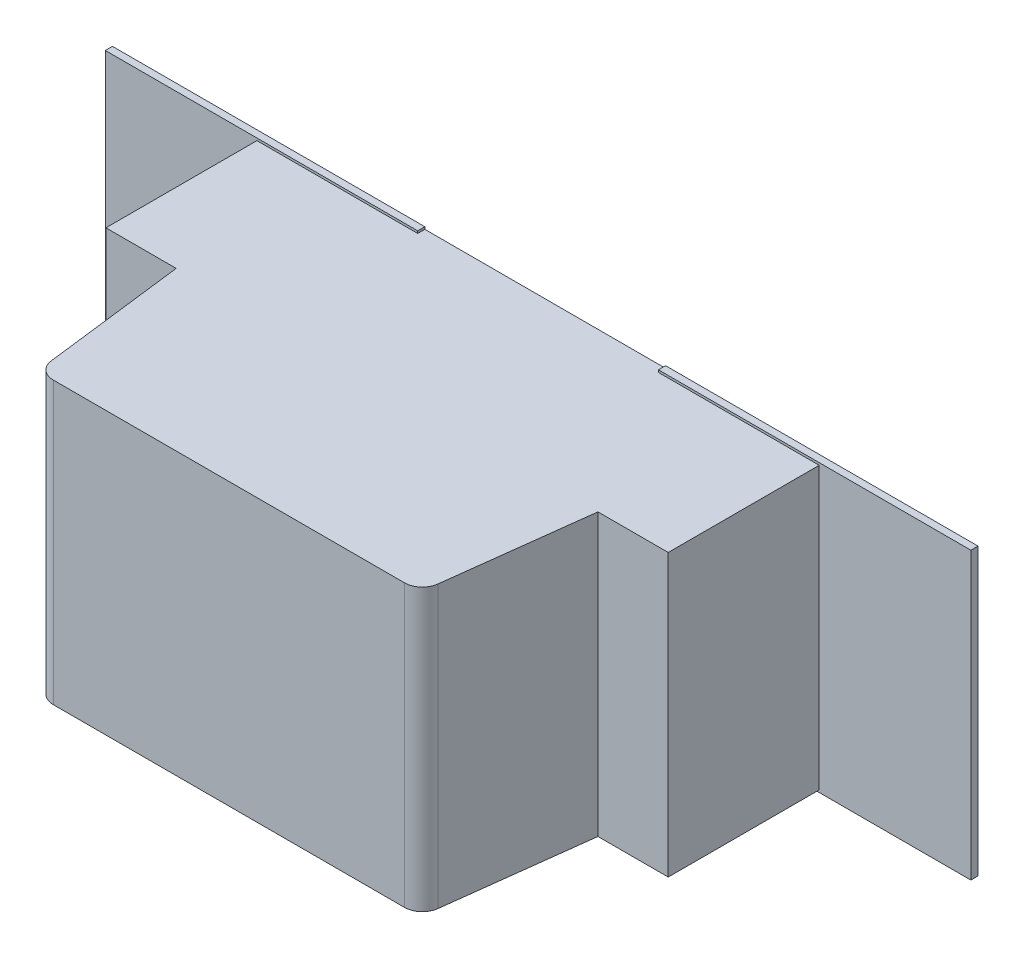
ISO-10303-21;
HEADER;
FILE_DESCRIPTION(('STEP AP214'),'2;1');
FILE_NAME('part.step','',(''),(''),'','','');
FILE_SCHEMA(('AUTOMOTIVE_DESIGN { 1 0 10303 214 1 1 1 1 }'));
ENDSEC;
DATA;
#1=APPLICATION_CONTEXT('core data for automotive mechanical design processes');
#2=APPLICATION_PROTOCOL_DEFINITION('international standard','automotive_design',2000,#1);
#3=PRODUCT_CONTEXT('',#1,'mechanical');
#4=PRODUCT('Part','Part','',(#3));
#5=PRODUCT_RELATED_PRODUCT_CATEGORY('part','',(#4));
#6=PRODUCT_DEFINITION_FORMATION('','',#4);
#7=PRODUCT_DEFINITION_CONTEXT('part definition',#1,'design');
#8=PRODUCT_DEFINITION('design','',#6,#7);
#9=PRODUCT_DEFINITION_SHAPE('','',#8);
#10=(LENGTH_UNIT() NAMED_UNIT(*) SI_UNIT(.MILLI.,.METRE.));
#11=(NAMED_UNIT(*) PLANE_ANGLE_UNIT() SI_UNIT($,.RADIAN.));
#12=(NAMED_UNIT(*) SI_UNIT($,.STERADIAN.) SOLID_ANGLE_UNIT());
#13=UNCERTAINTY_MEASURE_WITH_UNIT(LENGTH_MEASURE(1.E-05),#10,'distance_accuracy_value','');
#14=(GEOMETRIC_REPRESENTATION_CONTEXT(3) GLOBAL_UNCERTAINTY_ASSIGNED_CONTEXT((#13)) GLOBAL_UNIT_ASSIGNED_CONTEXT((#10,
#11,#12)) REPRESENTATION_CONTEXT('',''));
#15=CARTESIAN_POINT('',(0.,0.,0.));
#16=DIRECTION('',(0.,0.,1.));
#17=DIRECTION('',(1.,0.,0.));
#18=AXIS2_PLACEMENT_3D('',#15,#16,#17);
#19=CARTESIAN_POINT('',(1.2314936,0.4065016,0.0762));
#20=DIRECTION('',(0.,1.,0.));
#21=DIRECTION('',(1.,0.,0.));
#22=AXIS2_PLACEMENT_3D('',#19,#20,#21);
#23=PLANE('',#22);
#24=DIRECTION('',(-1.,0.,0.));
#25=VECTOR('',#24,1.);
#26=CARTESIAN_POINT('',(1.2314936,0.4065016,0.0762));
#27=LINE('',#26,#25);
#28=CARTESIAN_POINT('',(1.2314936,0.4065016,0.0762));
#29=VERTEX_POINT('',#28);
#30=CARTESIAN_POINT('',(0.3424936,0.4065016,0.0762));
#31=VERTEX_POINT('',#30);
#32=EDGE_CURVE('E295',#29,#31,#27,.T.);
#33=ORIENTED_EDGE('',*,*,#32,.T.);
#34=DIRECTION('',(0.,0.,1.));
#35=VECTOR('',#34,1.);
#36=CARTESIAN_POINT('',(0.3424936,0.4065016,0.0762));
#37=LINE('',#36,#35);
#38=CARTESIAN_POINT('',(0.3424936,0.4065016,0.09652));
#39=VERTEX_POINT('',#38);
#40=EDGE_CURVE('E317',#31,#39,#37,.T.);
#41=ORIENTED_EDGE('',*,*,#40,.T.);
#42=DIRECTION('',(-1.,0.,0.));
#43=VECTOR('',#42,1.);
#44=CARTESIAN_POINT('',(1.2314936,0.4065016,0.09652));
#45=LINE('',#44,#43);
#46=CARTESIAN_POINT('',(1.2314936,0.4065016,0.09652));
#47=VERTEX_POINT('',#46);
#48=EDGE_CURVE('E340',#47,#39,#45,.T.);
#49=ORIENTED_EDGE('',*,*,#48,.F.);
#50=DIRECTION('',(0.,0.,1.));
#51=VECTOR('',#50,1.);
#52=CARTESIAN_POINT('',(1.2314936,0.4065016,0.0762));
#53=LINE('',#52,#51);
#54=EDGE_CURVE('E11',#29,#47,#53,.T.);
#55=ORIENTED_EDGE('',*,*,#54,.F.);
#56=EDGE_LOOP('',(#33,#41,#49,#55));
#57=FACE_BOUND('',#56,.T.);
#58=ADVANCED_FACE('F17',(#57),#23,.T.);
#59=CARTESIAN_POINT('',(1.2314936,-0.4065016,0.0762));
#60=DIRECTION('',(1.,0.,0.));
#61=DIRECTION('',(0.,1.,0.));
#62=AXIS2_PLACEMENT_3D('',#59,#60,#61);
#63=PLANE('',#62);
#64=DIRECTION('',(0.,1.,0.));
#65=VECTOR('',#64,1.);
#66=CARTESIAN_POINT('',(1.2314936,-0.4065016,0.0762));
#67=LINE('',#66,#65);
#68=CARTESIAN_POINT('',(1.2314936,-0.4065016,0.0762));
#69=VERTEX_POINT('',#68);
#70=EDGE_CURVE('E290',#69,#29,#67,.T.);
#71=ORIENTED_EDGE('',*,*,#70,.T.);
#72=ORIENTED_EDGE('',*,*,#54,.T.);
#73=DIRECTION('',(0.,1.,0.));
#74=VECTOR('',#73,1.);
#75=CARTESIAN_POINT('',(1.2314936,-0.4065016,0.09652));
#76=LINE('',#75,#74);
#77=CARTESIAN_POINT('',(1.2314936,-0.4065016,0.09652));
#78=VERTEX_POINT('',#77);
#79=EDGE_CURVE('E384',#78,#47,#76,.T.);
#80=ORIENTED_EDGE('',*,*,#79,.F.);
#81=DIRECTION('',(0.,0.,1.));
#82=VECTOR('',#81,1.);
#83=CARTESIAN_POINT('',(1.2314936,-0.4065016,0.0762));
#84=LINE('',#83,#82);
#85=EDGE_CURVE('E28',#69,#78,#84,.T.);
#86=ORIENTED_EDGE('',*,*,#85,.F.);
#87=EDGE_LOOP('',(#71,#72,#80,#86));
#88=FACE_BOUND('',#87,.T.);
#89=ADVANCED_FACE('F514',(#88),#63,.T.);
#90=CARTESIAN_POINT('',(0.3424936,-0.4065016,0.0762));
#91=DIRECTION('',(0.,-1.,0.));
#92=DIRECTION('',(0.,0.,-1.));
#93=AXIS2_PLACEMENT_3D('',#90,#91,#92);
#94=PLANE('',#93);
#95=DIRECTION('',(1.,0.,0.));
#96=VECTOR('',#95,1.);
#97=CARTESIAN_POINT('',(0.3424936,-0.4065016,0.0762));
#98=LINE('',#97,#96);
#99=CARTESIAN_POINT('',(0.3424936,-0.4065016,0.0762));
#100=VERTEX_POINT('',#99);
#101=EDGE_CURVE('E294',#100,#69,#98,.T.);
#102=ORIENTED_EDGE('',*,*,#101,.T.);
#103=ORIENTED_EDGE('',*,*,#85,.T.);
#104=DIRECTION('',(1.,0.,0.));
#105=VECTOR('',#104,1.);
#106=CARTESIAN_POINT('',(0.3424936,-0.4065016,0.09652));
#107=LINE('',#106,#105);
#108=CARTESIAN_POINT('',(0.3424936,-0.4065016,0.09652));
#109=VERTEX_POINT('',#108);
#110=EDGE_CURVE('E380',#109,#78,#107,.T.);
#111=ORIENTED_EDGE('',*,*,#110,.F.);
#112=DIRECTION('',(0.,0.,1.));
#113=VECTOR('',#112,1.);
#114=CARTESIAN_POINT('',(0.3424936,-0.4065016,0.0762));
#115=LINE('',#114,#113);
#116=EDGE_CURVE('E195',#100,#109,#115,.T.);
#117=ORIENTED_EDGE('',*,*,#116,.F.);
#118=EDGE_LOOP('',(#102,#103,#111,#117));
#119=FACE_BOUND('',#118,.T.);
#120=ADVANCED_FACE('F516',(#119),#94,.T.);
#121=CARTESIAN_POINT('',(0.3424936,0.4065016,0.0762));
#122=DIRECTION('',(-1.,0.,0.));
#123=DIRECTION('',(0.,0.,1.));
#124=AXIS2_PLACEMENT_3D('',#121,#122,#123);
#125=PLANE('',#124);
#126=DIRECTION('',(0.,0.,1.));
#127=VECTOR('',#126,1.);
#128=CARTESIAN_POINT('',(0.3424936,0.4,0.0762));
#129=LINE('',#128,#127);
#130=CARTESIAN_POINT('',(0.3424936,0.4,0.0762));
#131=VERTEX_POINT('',#130);
#132=CARTESIAN_POINT('',(0.3424936,0.4,0.09652));
#133=VERTEX_POINT('',#132);
#134=EDGE_CURVE('E282',#131,#133,#129,.T.);
#135=ORIENTED_EDGE('',*,*,#134,.T.);
#136=DIRECTION('',(0.,-1.,0.));
#137=VECTOR('',#136,1.);
#138=CARTESIAN_POINT('',(0.3424936,0.4065016,0.09652));
#139=LINE('',#138,#137);
#140=EDGE_CURVE('E335',#39,#133,#139,.T.);
#141=ORIENTED_EDGE('',*,*,#140,.F.);
#142=ORIENTED_EDGE('',*,*,#40,.F.);
#143=DIRECTION('',(0.,-1.,0.));
#144=VECTOR('',#143,1.);
#145=CARTESIAN_POINT('',(0.3424936,0.4065016,0.0762));
#146=LINE('',#145,#144);
#147=EDGE_CURVE('E362',#31,#131,#146,.T.);
#148=ORIENTED_EDGE('',*,*,#147,.T.);
#149=EDGE_LOOP('',(#135,#141,#142,#148));
#150=FACE_BOUND('',#149,.T.);
#151=ADVANCED_FACE('F504',(#150),#125,.T.);
#152=CARTESIAN_POINT('',(0.3424936,0.4065016,0.0762));
#153=DIRECTION('',(-1.,0.,0.));
#154=DIRECTION('',(0.,0.,1.));
#155=AXIS2_PLACEMENT_3D('',#152,#153,#154);
#156=PLANE('',#155);
#157=DIRECTION('',(0.,0.,1.));
#158=VECTOR('',#157,1.);
#159=CARTESIAN_POINT('',(0.3424936,-0.4,0.0762));
#160=LINE('',#159,#158);
#161=CARTESIAN_POINT('',(0.3424936,-0.4,0.0762));
#162=VERTEX_POINT('',#161);
#163=CARTESIAN_POINT('',(0.3424936,-0.4,0.09652));
#164=VERTEX_POINT('',#163);
#165=EDGE_CURVE('E444',#162,#164,#160,.T.);
#166=ORIENTED_EDGE('',*,*,#165,.F.);
#167=DIRECTION('',(0.,-1.,0.));
#168=VECTOR('',#167,1.);
#169=CARTESIAN_POINT('',(0.3424936,-0.4,0.0762));
#170=LINE('',#169,#168);
#171=EDGE_CURVE('E202',#162,#100,#170,.T.);
#172=ORIENTED_EDGE('',*,*,#171,.T.);
#173=ORIENTED_EDGE('',*,*,#116,.T.);
#174=DIRECTION('',(0.,-1.,0.));
#175=VECTOR('',#174,1.);
#176=CARTESIAN_POINT('',(0.3424936,-0.4,0.09652));
#177=LINE('',#176,#175);
#178=EDGE_CURVE('E385',#164,#109,#177,.T.);
#179=ORIENTED_EDGE('',*,*,#178,.F.);
#180=EDGE_LOOP('',(#166,#172,#173,#179));
#181=FACE_BOUND('',#180,.T.);
#182=ADVANCED_FACE('F517',(#181),#156,.T.);
#183=CARTESIAN_POINT('',(-1.2314936,-0.4065016,0.0762));
#184=DIRECTION('',(0.,-1.,0.));
#185=DIRECTION('',(0.,0.,-1.));
#186=AXIS2_PLACEMENT_3D('',#183,#184,#185);
#187=PLANE('',#186);
#188=DIRECTION('',(1.,0.,0.));
#189=VECTOR('',#188,1.);
#190=CARTESIAN_POINT('',(-1.2314936,-0.4065016,0.0762));
#191=LINE('',#190,#189);
#192=CARTESIAN_POINT('',(-1.2314936,-0.4065016,0.0762));
#193=VERTEX_POINT('',#192);
#194=CARTESIAN_POINT('',(-0.3424936,-0.4065016,0.0762));
#195=VERTEX_POINT('',#194);
#196=EDGE_CURVE('E138',#193,#195,#191,.T.);
#197=ORIENTED_EDGE('',*,*,#196,.T.);
#198=DIRECTION('',(0.,0.,1.));
#199=VECTOR('',#198,1.);
#200=CARTESIAN_POINT('',(-0.3424936,-0.4065016,0.0762));
#201=LINE('',#200,#199);
#202=CARTESIAN_POINT('',(-0.3424936,-0.4065016,0.09652));
#203=VERTEX_POINT('',#202);
#204=EDGE_CURVE('E114',#195,#203,#201,.T.);
#205=ORIENTED_EDGE('',*,*,#204,.T.);
#206=DIRECTION('',(1.,0.,0.));
#207=VECTOR('',#206,1.);
#208=CARTESIAN_POINT('',(-1.2314936,-0.4065016,0.09652));
#209=LINE('',#208,#207);
#210=CARTESIAN_POINT('',(-1.2314936,-0.4065016,0.09652));
#211=VERTEX_POINT('',#210);
#212=EDGE_CURVE('E334',#211,#203,#209,.T.);
#213=ORIENTED_EDGE('',*,*,#212,.F.);
#214=DIRECTION('',(0.,0.,1.));
#215=VECTOR('',#214,1.);
#216=CARTESIAN_POINT('',(-1.2314936,-0.4065016,0.0762));
#217=LINE('',#216,#215);
#218=EDGE_CURVE('E21',#193,#211,#217,.T.);
#219=ORIENTED_EDGE('',*,*,#218,.F.);
#220=EDGE_LOOP('',(#197,#205,#213,#219));
#221=FACE_BOUND('',#220,.T.);
#222=ADVANCED_FACE('F469',(#221),#187,.T.);
#223=CARTESIAN_POINT('',(-1.2314936,0.4065016,0.0762));
#224=DIRECTION('',(-1.,0.,0.));
#225=DIRECTION('',(0.,0.,1.));
#226=AXIS2_PLACEMENT_3D('',#223,#224,#225);
#227=PLANE('',#226);
#228=DIRECTION('',(0.,-1.,0.));
#229=VECTOR('',#228,1.);
#230=CARTESIAN_POINT('',(-1.2314936,0.4065016,0.0762));
#231=LINE('',#230,#229);
#232=CARTESIAN_POINT('',(-1.2314936,0.4065016,0.0762));
#233=VERTEX_POINT('',#232);
#234=EDGE_CURVE('E304',#233,#193,#231,.T.);
#235=ORIENTED_EDGE('',*,*,#234,.T.);
#236=ORIENTED_EDGE('',*,*,#218,.T.);
#237=DIRECTION('',(0.,-1.,0.));
#238=VECTOR('',#237,1.);
#239=CARTESIAN_POINT('',(-1.2314936,0.4065016,0.09652));
#240=LINE('',#239,#238);
#241=CARTESIAN_POINT('',(-1.2314936,0.4065016,0.09652));
#242=VERTEX_POINT('',#241);
#243=EDGE_CURVE('E371',#242,#211,#240,.T.);
#244=ORIENTED_EDGE('',*,*,#243,.F.);
#245=DIRECTION('',(0.,0.,1.));
#246=VECTOR('',#245,1.);
#247=CARTESIAN_POINT('',(-1.2314936,0.4065016,0.0762));
#248=LINE('',#247,#246);
#249=EDGE_CURVE('E42',#233,#242,#248,.T.);
#250=ORIENTED_EDGE('',*,*,#249,.F.);
#251=EDGE_LOOP('',(#235,#236,#244,#250));
#252=FACE_BOUND('',#251,.T.);
#253=ADVANCED_FACE('F465',(#252),#227,.T.);
#254=CARTESIAN_POINT('',(-0.3424936,0.4065016,0.0762));
#255=DIRECTION('',(0.,1.,0.));
#256=DIRECTION('',(1.,0.,0.));
#257=AXIS2_PLACEMENT_3D('',#254,#255,#256);
#258=PLANE('',#257);
#259=DIRECTION('',(-1.,0.,0.));
#260=VECTOR('',#259,1.);
#261=CARTESIAN_POINT('',(-0.3424936,0.4065016,0.0762));
#262=LINE('',#261,#260);
#263=CARTESIAN_POINT('',(-0.3424936,0.4065016,0.0762));
#264=VERTEX_POINT('',#263);
#265=EDGE_CURVE('E307',#264,#233,#262,.T.);
#266=ORIENTED_EDGE('',*,*,#265,.T.);
#267=ORIENTED_EDGE('',*,*,#249,.T.);
#268=DIRECTION('',(-1.,0.,0.));
#269=VECTOR('',#268,1.);
#270=CARTESIAN_POINT('',(-0.3424936,0.4065016,0.09652));
#271=LINE('',#270,#269);
#272=CARTESIAN_POINT('',(-0.3424936,0.4065016,0.09652));
#273=VERTEX_POINT('',#272);
#274=EDGE_CURVE('E352',#273,#242,#271,.T.);
#275=ORIENTED_EDGE('',*,*,#274,.F.);
#276=DIRECTION('',(0.,0.,1.));
#277=VECTOR('',#276,1.);
#278=CARTESIAN_POINT('',(-0.3424936,0.4065016,0.0762));
#279=LINE('',#278,#277);
#280=EDGE_CURVE('E395',#264,#273,#279,.T.);
#281=ORIENTED_EDGE('',*,*,#280,.F.);
#282=EDGE_LOOP('',(#266,#267,#275,#281));
#283=FACE_BOUND('',#282,.T.);
#284=ADVANCED_FACE('F462',(#283),#258,.T.);
#285=CARTESIAN_POINT('',(0.8,-0.4,0.0762));
#286=DIRECTION('',(0.,0.,-1.));
#287=DIRECTION('',(0.,-1.,0.));
#288=AXIS2_PLACEMENT_3D('',#285,#286,#287);
#289=PLANE('',#288);
#290=DIRECTION('',(-1.,0.,0.));
#291=VECTOR('',#290,1.);
#292=CARTESIAN_POINT('',(0.3424936,0.4,0.0762));
#293=LINE('',#292,#291);
#294=CARTESIAN_POINT('',(-0.3424936,0.4,0.0762));
#295=VERTEX_POINT('',#294);
#296=EDGE_CURVE('E285',#131,#295,#293,.T.);
#297=ORIENTED_EDGE('',*,*,#296,.F.);
#298=ORIENTED_EDGE('',*,*,#147,.F.);
#299=ORIENTED_EDGE('',*,*,#32,.F.);
#300=ORIENTED_EDGE('',*,*,#70,.F.);
#301=ORIENTED_EDGE('',*,*,#101,.F.);
#302=ORIENTED_EDGE('',*,*,#171,.F.);
#303=DIRECTION('',(-1.,0.,0.));
#304=VECTOR('',#303,1.);
#305=CARTESIAN_POINT('',(0.3424936,-0.4,0.0762));
#306=LINE('',#305,#304);
#307=CARTESIAN_POINT('',(-0.3424936,-0.4,0.0762));
#308=VERTEX_POINT('',#307);
#309=EDGE_CURVE('E426',#162,#308,#306,.T.);
#310=ORIENTED_EDGE('',*,*,#309,.T.);
#311=DIRECTION('',(0.,1.,0.));
#312=VECTOR('',#311,1.);
#313=CARTESIAN_POINT('',(-0.3424936,-0.4065016,0.0762));
#314=LINE('',#313,#312);
#315=EDGE_CURVE('E209',#195,#308,#314,.T.);
#316=ORIENTED_EDGE('',*,*,#315,.F.);
#317=ORIENTED_EDGE('',*,*,#196,.F.);
#318=ORIENTED_EDGE('',*,*,#234,.F.);
#319=ORIENTED_EDGE('',*,*,#265,.F.);
#320=DIRECTION('',(0.,1.,0.));
#321=VECTOR('',#320,1.);
#322=CARTESIAN_POINT('',(-0.3424936,0.4,0.0762));
#323=LINE('',#322,#321);
#324=EDGE_CURVE('E130',#295,#264,#323,.T.);
#325=ORIENTED_EDGE('',*,*,#324,.F.);
#326=EDGE_LOOP('',(#297,#298,#299,#300,#301,#302,#310,#316,#317,#318,#319,#325));
#327=FACE_BOUND('',#326,.T.);
#328=ADVANCED_FACE('F464',(#327),#289,.T.);
#329=CARTESIAN_POINT('',(-0.3424936,-0.4065016,0.0762));
#330=DIRECTION('',(1.,0.,0.));
#331=DIRECTION('',(0.,1.,0.));
#332=AXIS2_PLACEMENT_3D('',#329,#330,#331);
#333=PLANE('',#332);
#334=DIRECTION('',(0.,0.,1.));
#335=VECTOR('',#334,1.);
#336=CARTESIAN_POINT('',(-0.3424936,0.4,0.0762));
#337=LINE('',#336,#335);
#338=CARTESIAN_POINT('',(-0.3424936,0.4,0.09652));
#339=VERTEX_POINT('',#338);
#340=EDGE_CURVE('E289',#295,#339,#337,.T.);
#341=ORIENTED_EDGE('',*,*,#340,.F.);
#342=ORIENTED_EDGE('',*,*,#324,.T.);
#343=ORIENTED_EDGE('',*,*,#280,.T.);
#344=DIRECTION('',(0.,1.,0.));
#345=VECTOR('',#344,1.);
#346=CARTESIAN_POINT('',(-0.3424936,0.4,0.09652));
#347=LINE('',#346,#345);
#348=EDGE_CURVE('E348',#339,#273,#347,.T.);
#349=ORIENTED_EDGE('',*,*,#348,.F.);
#350=EDGE_LOOP('',(#341,#342,#343,#349));
#351=FACE_BOUND('',#350,.T.);
#352=ADVANCED_FACE('F555',(#351),#333,.T.);
#353=CARTESIAN_POINT('',(-0.3424936,-0.4065016,0.0762));
#354=DIRECTION('',(1.,0.,0.));
#355=DIRECTION('',(0.,1.,0.));
#356=AXIS2_PLACEMENT_3D('',#353,#354,#355);
#357=PLANE('',#356);
#358=DIRECTION('',(0.,0.,1.));
#359=VECTOR('',#358,1.);
#360=CARTESIAN_POINT('',(-0.3424936,-0.4,0.0762));
#361=LINE('',#360,#359);
#362=CARTESIAN_POINT('',(-0.3424936,-0.4,0.09652));
#363=VERTEX_POINT('',#362);
#364=EDGE_CURVE('E322',#308,#363,#361,.T.);
#365=ORIENTED_EDGE('',*,*,#364,.T.);
#366=DIRECTION('',(0.,1.,0.));
#367=VECTOR('',#366,1.);
#368=CARTESIAN_POINT('',(-0.3424936,-0.4065016,0.09652));
#369=LINE('',#368,#367);
#370=EDGE_CURVE('E330',#203,#363,#369,.T.);
#371=ORIENTED_EDGE('',*,*,#370,.F.);
#372=ORIENTED_EDGE('',*,*,#204,.F.);
#373=ORIENTED_EDGE('',*,*,#315,.T.);
#374=EDGE_LOOP('',(#365,#371,#372,#373));
#375=FACE_BOUND('',#374,.T.);
#376=ADVANCED_FACE('F553',(#375),#357,.T.);
#377=CARTESIAN_POINT('',(0.,0.4,0.0762));
#378=DIRECTION('',(0.,1.,0.));
#379=DIRECTION('',(1.,0.,0.));
#380=AXIS2_PLACEMENT_3D('',#377,#378,#379);
#381=PLANE('',#380);
#382=DIRECTION('',(-1.,0.,0.));
#383=VECTOR('',#382,1.);
#384=CARTESIAN_POINT('',(0.8,0.4,0.09652));
#385=LINE('',#384,#383);
#386=CARTESIAN_POINT('',(0.8,0.4,0.09652));
#387=VERTEX_POINT('',#386);
#388=EDGE_CURVE('E339',#387,#133,#385,.T.);
#389=ORIENTED_EDGE('',*,*,#388,.T.);
#390=ORIENTED_EDGE('',*,*,#134,.F.);
#391=ORIENTED_EDGE('',*,*,#296,.T.);
#392=ORIENTED_EDGE('',*,*,#340,.T.);
#393=DIRECTION('',(-1.,0.,0.));
#394=VECTOR('',#393,1.);
#395=CARTESIAN_POINT('',(-0.3424936,0.4,0.09652));
#396=LINE('',#395,#394);
#397=CARTESIAN_POINT('',(-0.8,0.4,0.09652));
#398=VERTEX_POINT('',#397);
#399=EDGE_CURVE('E353',#339,#398,#396,.T.);
#400=ORIENTED_EDGE('',*,*,#399,.T.);
#401=DIRECTION('',(0.,0.,1.));
#402=VECTOR('',#401,1.);
#403=CARTESIAN_POINT('',(-0.8,0.4,0.09652));
#404=LINE('',#403,#402);
#405=CARTESIAN_POINT('',(-0.8,0.4,0.5262));
#406=VERTEX_POINT('',#405);
#407=EDGE_CURVE('E286',#398,#406,#404,.T.);
#408=ORIENTED_EDGE('',*,*,#407,.T.);
#409=DIRECTION('',(1.,0.,0.));
#410=VECTOR('',#409,1.);
#411=CARTESIAN_POINT('',(-0.8,0.4,0.5262));
#412=LINE('',#411,#410);
#413=CARTESIAN_POINT('',(-0.6,0.4,0.5262));
#414=VERTEX_POINT('',#413);
#415=EDGE_CURVE('E389',#406,#414,#412,.T.);
#416=ORIENTED_EDGE('',*,*,#415,.T.);
#417=DIRECTION('',(0.122402128164196,0.,0.992480588737571));
#418=VECTOR('',#417,1.);
#419=CARTESIAN_POINT('',(-0.6,0.4,0.5262));
#420=LINE('',#419,#418);
#421=CARTESIAN_POINT('',(-0.55,0.4,0.9316180281107));
#422=VERTEX_POINT('',#421);
#423=EDGE_CURVE('E324',#414,#422,#420,.T.);
#424=ORIENTED_EDGE('',*,*,#423,.T.);
#425=CARTESIAN_POINT('',(-0.4995819860921,0.4,0.9254));
#426=DIRECTION('',(0.,1.,0.));
#427=DIRECTION('',(-0.992480588737571,0.,0.122402128164196));
#428=AXIS2_PLACEMENT_3D('',#425,#426,#427);
#429=CIRCLE('',#428,0.0508);
#430=CARTESIAN_POINT('',(-0.4995819860921,0.4,0.9762));
#431=VERTEX_POINT('',#430);
#432=EDGE_CURVE('E344',#422,#431,#429,.T.);
#433=ORIENTED_EDGE('',*,*,#432,.T.);
#434=DIRECTION('',(1.,0.,0.));
#435=VECTOR('',#434,1.);
#436=CARTESIAN_POINT('',(-0.4995819860921,0.4,0.9762));
#437=LINE('',#436,#435);
#438=CARTESIAN_POINT('',(0.4995819860921,0.4,0.9762));
#439=VERTEX_POINT('',#438);
#440=EDGE_CURVE('E244',#431,#439,#437,.T.);
#441=ORIENTED_EDGE('',*,*,#440,.T.);
#442=CARTESIAN_POINT('',(0.4995819860921,0.4,0.9254));
#443=DIRECTION('',(0.,1.,0.));
#444=DIRECTION('',(0.,0.,1.));
#445=AXIS2_PLACEMENT_3D('',#442,#443,#444);
#446=CIRCLE('',#445,0.0508);
#447=CARTESIAN_POINT('',(0.55,0.4,0.9316180281107));
#448=VERTEX_POINT('',#447);
#449=EDGE_CURVE('E249',#439,#448,#446,.T.);
#450=ORIENTED_EDGE('',*,*,#449,.T.);
#451=DIRECTION('',(0.122402128164196,0.,-0.992480588737571));
#452=VECTOR('',#451,1.);
#453=CARTESIAN_POINT('',(0.55,0.4,0.9316180281107));
#454=LINE('',#453,#452);
#455=CARTESIAN_POINT('',(0.6,0.4,0.5262));
#456=VERTEX_POINT('',#455);
#457=EDGE_CURVE('E254',#448,#456,#454,.T.);
#458=ORIENTED_EDGE('',*,*,#457,.T.);
#459=DIRECTION('',(1.,0.,0.));
#460=VECTOR('',#459,1.);
#461=CARTESIAN_POINT('',(0.6,0.4,0.5262));
#462=LINE('',#461,#460);
#463=CARTESIAN_POINT('',(0.8,0.4,0.5262));
#464=VERTEX_POINT('',#463);
#465=EDGE_CURVE('E101',#456,#464,#462,.T.);
#466=ORIENTED_EDGE('',*,*,#465,.T.);
#467=DIRECTION('',(0.,0.,-1.));
#468=VECTOR('',#467,1.);
#469=CARTESIAN_POINT('',(0.8,0.4,0.5262));
#470=LINE('',#469,#468);
#471=EDGE_CURVE('E333',#464,#387,#470,.T.);
#472=ORIENTED_EDGE('',*,*,#471,.T.);
#473=EDGE_LOOP('',(#389,#390,#391,#392,#400,#408,#416,#424,#433,#441,#450,#458,#466,#472));
#474=FACE_BOUND('',#473,.T.);
#475=ADVANCED_FACE('F252',(#474),#381,.T.);
#476=CARTESIAN_POINT('',(-0.8,-0.4,0.0762));
#477=DIRECTION('',(-1.,0.,0.));
#478=DIRECTION('',(0.,0.,1.));
#479=AXIS2_PLACEMENT_3D('',#476,#477,#478);
#480=PLANE('',#479);
#481=DIRECTION('',(0.,1.,0.));
#482=VECTOR('',#481,1.);
#483=CARTESIAN_POINT('',(-0.8,-0.4,0.09652));
#484=LINE('',#483,#482);
#485=CARTESIAN_POINT('',(-0.8,-0.4,0.09652));
#486=VERTEX_POINT('',#485);
#487=EDGE_CURVE('E375',#486,#398,#484,.T.);
#488=ORIENTED_EDGE('',*,*,#487,.F.);
#489=DIRECTION('',(0.,0.,1.));
#490=VECTOR('',#489,1.);
#491=CARTESIAN_POINT('',(-0.8,-0.4,0.09652));
#492=LINE('',#491,#490);
#493=CARTESIAN_POINT('',(-0.8,-0.4,0.5262));
#494=VERTEX_POINT('',#493);
#495=EDGE_CURVE('E323',#486,#494,#492,.T.);
#496=ORIENTED_EDGE('',*,*,#495,.T.);
#497=DIRECTION('',(0.,1.,0.));
#498=VECTOR('',#497,1.);
#499=CARTESIAN_POINT('',(-0.8,-0.4,0.5262));
#500=LINE('',#499,#498);
#501=EDGE_CURVE('E392',#494,#406,#500,.T.);
#502=ORIENTED_EDGE('',*,*,#501,.T.);
#503=ORIENTED_EDGE('',*,*,#407,.F.);
#504=EDGE_LOOP('',(#488,#496,#502,#503));
#505=FACE_BOUND('',#504,.T.);
#506=ADVANCED_FACE('F552',(#505),#480,.T.);
#507=CARTESIAN_POINT('',(-0.8,-0.4,0.5262));
#508=DIRECTION('',(0.,0.,1.));
#509=DIRECTION('',(1.,0.,0.));
#510=AXIS2_PLACEMENT_3D('',#507,#508,#509);
#511=PLANE('',#510);
#512=DIRECTION('',(1.,0.,0.));
#513=VECTOR('',#512,1.);
#514=CARTESIAN_POINT('',(-0.8,-0.4,0.5262));
#515=LINE('',#514,#513);
#516=CARTESIAN_POINT('',(-0.6,-0.4,0.5262));
#517=VERTEX_POINT('',#516);
#518=EDGE_CURVE('E354',#494,#517,#515,.T.);
#519=ORIENTED_EDGE('',*,*,#518,.T.);
#520=DIRECTION('',(0.,1.,0.));
#521=VECTOR('',#520,1.);
#522=CARTESIAN_POINT('',(-0.6,-0.4,0.5262));
#523=LINE('',#522,#521);
#524=EDGE_CURVE('E280',#517,#414,#523,.T.);
#525=ORIENTED_EDGE('',*,*,#524,.T.);
#526=ORIENTED_EDGE('',*,*,#415,.F.);
#527=ORIENTED_EDGE('',*,*,#501,.F.);
#528=EDGE_LOOP('',(#519,#525,#526,#527));
#529=FACE_BOUND('',#528,.T.);
#530=ADVANCED_FACE('F573',(#529),#511,.T.);
#531=CARTESIAN_POINT('',(-0.6,-0.4,0.5262));
#532=DIRECTION('',(-0.992480588737571,0.,0.122402128164196));
#533=DIRECTION('',(0.,1.,0.));
#534=AXIS2_PLACEMENT_3D('',#531,#532,#533);
#535=PLANE('',#534);
#536=DIRECTION('',(0.122402128164196,0.,0.992480588737571));
#537=VECTOR('',#536,1.);
#538=CARTESIAN_POINT('',(-0.6,-0.4,0.5262));
#539=LINE('',#538,#537);
#540=CARTESIAN_POINT('',(-0.55,-0.4,0.9316180281107));
#541=VERTEX_POINT('',#540);
#542=EDGE_CURVE('E358',#517,#541,#539,.T.);
#543=ORIENTED_EDGE('',*,*,#542,.T.);
#544=DIRECTION('',(0.,1.,0.));
#545=VECTOR('',#544,1.);
#546=CARTESIAN_POINT('',(-0.55,-0.4,0.9316180281107));
#547=LINE('',#546,#545);
#548=EDGE_CURVE('E327',#541,#422,#547,.T.);
#549=ORIENTED_EDGE('',*,*,#548,.T.);
#550=ORIENTED_EDGE('',*,*,#423,.F.);
#551=ORIENTED_EDGE('',*,*,#524,.F.);
#552=EDGE_LOOP('',(#543,#549,#550,#551));
#553=FACE_BOUND('',#552,.T.);
#554=ADVANCED_FACE('F548',(#553),#535,.T.);
#555=CARTESIAN_POINT('',(-0.4995819860921,-0.4,0.9254));
#556=DIRECTION('',(0.,1.,0.));
#557=DIRECTION('',(-1.,0.,0.));
#558=AXIS2_PLACEMENT_3D('',#555,#556,#557);
#559=CYLINDRICAL_SURFACE('',#558,0.0508);
#560=CARTESIAN_POINT('',(-0.4995819860921,-0.4,0.9254));
#561=DIRECTION('',(0.,1.,0.));
#562=DIRECTION('',(-0.992480588737571,0.,0.122402128164196));
#563=AXIS2_PLACEMENT_3D('',#560,#561,#562);
#564=CIRCLE('',#563,0.0508);
#565=CARTESIAN_POINT('',(-0.4995819860921,-0.4,0.9762));
#566=VERTEX_POINT('',#565);
#567=EDGE_CURVE('E300',#541,#566,#564,.T.);
#568=ORIENTED_EDGE('',*,*,#567,.T.);
#569=DIRECTION('',(0.,1.,0.));
#570=VECTOR('',#569,1.);
#571=CARTESIAN_POINT('',(-0.4995819860921,-0.4,0.9762));
#572=LINE('',#571,#570);
#573=EDGE_CURVE('E347',#566,#431,#572,.T.);
#574=ORIENTED_EDGE('',*,*,#573,.T.);
#575=ORIENTED_EDGE('',*,*,#432,.F.);
#576=ORIENTED_EDGE('',*,*,#548,.F.);
#577=EDGE_LOOP('',(#568,#574,#575,#576));
#578=FACE_BOUND('',#577,.T.);
#579=ADVANCED_FACE('F544',(#578),#559,.T.);
#580=CARTESIAN_POINT('',(-0.4995819860921,-0.4,0.9762));
#581=DIRECTION('',(0.,0.,1.));
#582=DIRECTION('',(1.,0.,0.));
#583=AXIS2_PLACEMENT_3D('',#580,#581,#582);
#584=PLANE('',#583);
#585=DIRECTION('',(1.,0.,0.));
#586=VECTOR('',#585,1.);
#587=CARTESIAN_POINT('',(-0.4995819860921,-0.4,0.9762));
#588=LINE('',#587,#586);
#589=CARTESIAN_POINT('',(0.4995819860921,-0.4,0.9762));
#590=VERTEX_POINT('',#589);
#591=EDGE_CURVE('E296',#566,#590,#588,.T.);
#592=ORIENTED_EDGE('',*,*,#591,.T.);
#593=DIRECTION('',(0.,1.,0.));
#594=VECTOR('',#593,1.);
#595=CARTESIAN_POINT('',(0.4995819860921,-0.4,0.9762));
#596=LINE('',#595,#594);
#597=EDGE_CURVE('E258',#590,#439,#596,.T.);
#598=ORIENTED_EDGE('',*,*,#597,.T.);
#599=ORIENTED_EDGE('',*,*,#440,.F.);
#600=ORIENTED_EDGE('',*,*,#573,.F.);
#601=EDGE_LOOP('',(#592,#598,#599,#600));
#602=FACE_BOUND('',#601,.T.);
#603=ADVANCED_FACE('F547',(#602),#584,.T.);
#604=CARTESIAN_POINT('',(0.4995819860921,-0.4,0.9254));
#605=DIRECTION('',(0.,1.,0.));
#606=DIRECTION('',(-1.,0.,0.));
#607=AXIS2_PLACEMENT_3D('',#604,#605,#606);
#608=CYLINDRICAL_SURFACE('',#607,0.0508);
#609=CARTESIAN_POINT('',(0.4995819860921,-0.4,0.9254));
#610=DIRECTION('',(0.,1.,0.));
#611=DIRECTION('',(0.,0.,1.));
#612=AXIS2_PLACEMENT_3D('',#609,#610,#611);
#613=CIRCLE('',#612,0.0508);
#614=CARTESIAN_POINT('',(0.55,-0.4,0.9316180281107));
#615=VERTEX_POINT('',#614);
#616=EDGE_CURVE('E264',#590,#615,#613,.T.);
#617=ORIENTED_EDGE('',*,*,#616,.T.);
#618=DIRECTION('',(0.,1.,0.));
#619=VECTOR('',#618,1.);
#620=CARTESIAN_POINT('',(0.55,-0.4,0.9316180281107));
#621=LINE('',#620,#619);
#622=EDGE_CURVE('E259',#615,#448,#621,.T.);
#623=ORIENTED_EDGE('',*,*,#622,.T.);
#624=ORIENTED_EDGE('',*,*,#449,.F.);
#625=ORIENTED_EDGE('',*,*,#597,.F.);
#626=EDGE_LOOP('',(#617,#623,#624,#625));
#627=FACE_BOUND('',#626,.T.);
#628=ADVANCED_FACE('F262',(#627),#608,.T.);
#629=CARTESIAN_POINT('',(0.55,-0.4,0.9316180281107));
#630=DIRECTION('',(0.992480588737571,0.,0.122402128164196));
#631=DIRECTION('',(0.,-1.,0.));
#632=AXIS2_PLACEMENT_3D('',#629,#630,#631);
#633=PLANE('',#632);
#634=DIRECTION('',(0.122402128164196,0.,-0.992480588737571));
#635=VECTOR('',#634,1.);
#636=CARTESIAN_POINT('',(0.55,-0.4,0.9316180281107));
#637=LINE('',#636,#635);
#638=CARTESIAN_POINT('',(0.6,-0.4,0.5262));
#639=VERTEX_POINT('',#638);
#640=EDGE_CURVE('E400',#615,#639,#637,.T.);
#641=ORIENTED_EDGE('',*,*,#640,.T.);
#642=DIRECTION('',(0.,1.,0.));
#643=VECTOR('',#642,1.);
#644=CARTESIAN_POINT('',(0.6,-0.4,0.5262));
#645=LINE('',#644,#643);
#646=EDGE_CURVE('E270',#639,#456,#645,.T.);
#647=ORIENTED_EDGE('',*,*,#646,.T.);
#648=ORIENTED_EDGE('',*,*,#457,.F.);
#649=ORIENTED_EDGE('',*,*,#622,.F.);
#650=EDGE_LOOP('',(#641,#647,#648,#649));
#651=FACE_BOUND('',#650,.T.);
#652=ADVANCED_FACE('F19',(#651),#633,.T.);
#653=CARTESIAN_POINT('',(0.6,-0.4,0.5262));
#654=DIRECTION('',(0.,0.,1.));
#655=DIRECTION('',(1.,0.,0.));
#656=AXIS2_PLACEMENT_3D('',#653,#654,#655);
#657=PLANE('',#656);
#658=DIRECTION('',(1.,0.,0.));
#659=VECTOR('',#658,1.);
#660=CARTESIAN_POINT('',(0.6,-0.4,0.5262));
#661=LINE('',#660,#659);
#662=CARTESIAN_POINT('',(0.8,-0.4,0.5262));
#663=VERTEX_POINT('',#662);
#664=EDGE_CURVE('E411',#639,#663,#661,.T.);
#665=ORIENTED_EDGE('',*,*,#664,.T.);
#666=DIRECTION('',(0.,1.,0.));
#667=VECTOR('',#666,1.);
#668=CARTESIAN_POINT('',(0.8,-0.4,0.5262));
#669=LINE('',#668,#667);
#670=EDGE_CURVE('E343',#663,#464,#669,.T.);
#671=ORIENTED_EDGE('',*,*,#670,.T.);
#672=ORIENTED_EDGE('',*,*,#465,.F.);
#673=ORIENTED_EDGE('',*,*,#646,.F.);
#674=EDGE_LOOP('',(#665,#671,#672,#673));
#675=FACE_BOUND('',#674,.T.);
#676=ADVANCED_FACE('F537',(#675),#657,.T.);
#677=CARTESIAN_POINT('',(0.8,-0.4,0.5262));
#678=DIRECTION('',(1.,0.,0.));
#679=DIRECTION('',(0.,1.,0.));
#680=AXIS2_PLACEMENT_3D('',#677,#678,#679);
#681=PLANE('',#680);
#682=DIRECTION('',(0.,1.,0.));
#683=VECTOR('',#682,1.);
#684=CARTESIAN_POINT('',(0.8,-0.4,0.09652));
#685=LINE('',#684,#683);
#686=CARTESIAN_POINT('',(0.8,-0.4,0.09652));
#687=VERTEX_POINT('',#686);
#688=EDGE_CURVE('E367',#687,#387,#685,.T.);
#689=ORIENTED_EDGE('',*,*,#688,.T.);
#690=ORIENTED_EDGE('',*,*,#471,.F.);
#691=ORIENTED_EDGE('',*,*,#670,.F.);
#692=DIRECTION('',(0.,0.,-1.));
#693=VECTOR('',#692,1.);
#694=CARTESIAN_POINT('',(0.8,-0.4,0.5262));
#695=LINE('',#694,#693);
#696=EDGE_CURVE('E407',#663,#687,#695,.T.);
#697=ORIENTED_EDGE('',*,*,#696,.T.);
#698=EDGE_LOOP('',(#689,#690,#691,#697));
#699=FACE_BOUND('',#698,.T.);
#700=ADVANCED_FACE('F540',(#699),#681,.T.);
#701=CARTESIAN_POINT('',(0.,0.,0.09652));
#702=DIRECTION('',(0.,0.,1.));
#703=DIRECTION('',(1.,0.,0.));
#704=AXIS2_PLACEMENT_3D('',#701,#702,#703);
#705=PLANE('',#704);
#706=DIRECTION('',(-1.,0.,0.));
#707=VECTOR('',#706,1.);
#708=CARTESIAN_POINT('',(-0.3424936,-0.4,0.09652));
#709=LINE('',#708,#707);
#710=EDGE_CURVE('E318',#363,#486,#709,.T.);
#711=ORIENTED_EDGE('',*,*,#710,.T.);
#712=ORIENTED_EDGE('',*,*,#487,.T.);
#713=ORIENTED_EDGE('',*,*,#399,.F.);
#714=ORIENTED_EDGE('',*,*,#348,.T.);
#715=ORIENTED_EDGE('',*,*,#274,.T.);
#716=ORIENTED_EDGE('',*,*,#243,.T.);
#717=ORIENTED_EDGE('',*,*,#212,.T.);
#718=ORIENTED_EDGE('',*,*,#370,.T.);
#719=EDGE_LOOP('',(#711,#712,#713,#714,#715,#716,#717,#718));
#720=FACE_BOUND('',#719,.T.);
#721=ADVANCED_FACE('F473',(#720),#705,.T.);
#722=CARTESIAN_POINT('',(0.,0.,0.09652));
#723=DIRECTION('',(0.,0.,1.));
#724=DIRECTION('',(1.,0.,0.));
#725=AXIS2_PLACEMENT_3D('',#722,#723,#724);
#726=PLANE('',#725);
#727=DIRECTION('',(-1.,0.,0.));
#728=VECTOR('',#727,1.);
#729=CARTESIAN_POINT('',(0.8,-0.4,0.09652));
#730=LINE('',#729,#728);
#731=EDGE_CURVE('E412',#687,#164,#730,.T.);
#732=ORIENTED_EDGE('',*,*,#731,.T.);
#733=ORIENTED_EDGE('',*,*,#178,.T.);
#734=ORIENTED_EDGE('',*,*,#110,.T.);
#735=ORIENTED_EDGE('',*,*,#79,.T.);
#736=ORIENTED_EDGE('',*,*,#48,.T.);
#737=ORIENTED_EDGE('',*,*,#140,.T.);
#738=ORIENTED_EDGE('',*,*,#388,.F.);
#739=ORIENTED_EDGE('',*,*,#688,.F.);
#740=EDGE_LOOP('',(#732,#733,#734,#735,#736,#737,#738,#739));
#741=FACE_BOUND('',#740,.T.);
#742=ADVANCED_FACE('F436',(#741),#726,.T.);
#743=CARTESIAN_POINT('',(0.,-0.4,0.0762));
#744=DIRECTION('',(0.,1.,0.));
#745=DIRECTION('',(1.,0.,0.));
#746=AXIS2_PLACEMENT_3D('',#743,#744,#745);
#747=PLANE('',#746);
#748=ORIENTED_EDGE('',*,*,#731,.F.);
#749=ORIENTED_EDGE('',*,*,#696,.F.);
#750=ORIENTED_EDGE('',*,*,#664,.F.);
#751=ORIENTED_EDGE('',*,*,#640,.F.);
#752=ORIENTED_EDGE('',*,*,#616,.F.);
#753=ORIENTED_EDGE('',*,*,#591,.F.);
#754=ORIENTED_EDGE('',*,*,#567,.F.);
#755=ORIENTED_EDGE('',*,*,#542,.F.);
#756=ORIENTED_EDGE('',*,*,#518,.F.);
#757=ORIENTED_EDGE('',*,*,#495,.F.);
#758=ORIENTED_EDGE('',*,*,#710,.F.);
#759=ORIENTED_EDGE('',*,*,#364,.F.);
#760=ORIENTED_EDGE('',*,*,#309,.F.);
#761=ORIENTED_EDGE('',*,*,#165,.T.);
#762=EDGE_LOOP('',(#748,#749,#750,#751,#752,#753,#754,#755,#756,#757,#758,#759,#760,#761));
#763=FACE_BOUND('',#762,.T.);
#764=ADVANCED_FACE('F441',(#763),#747,.F.);
#765=CLOSED_SHELL('',(#58,#89,#120,#151,#182,#222,#253,#284,#328,#352,#376,#475,#506,#530,#554,
#579,#603,#628,#652,#676,#700,#721,#742,#764));
#766=MANIFOLD_SOLID_BREP('B1',#765);
#767=ADVANCED_BREP_SHAPE_REPRESENTATION('',(#18,#766),#14);
#768=SHAPE_DEFINITION_REPRESENTATION(#9,#767);
ENDSEC;
END-ISO-10303-21;
